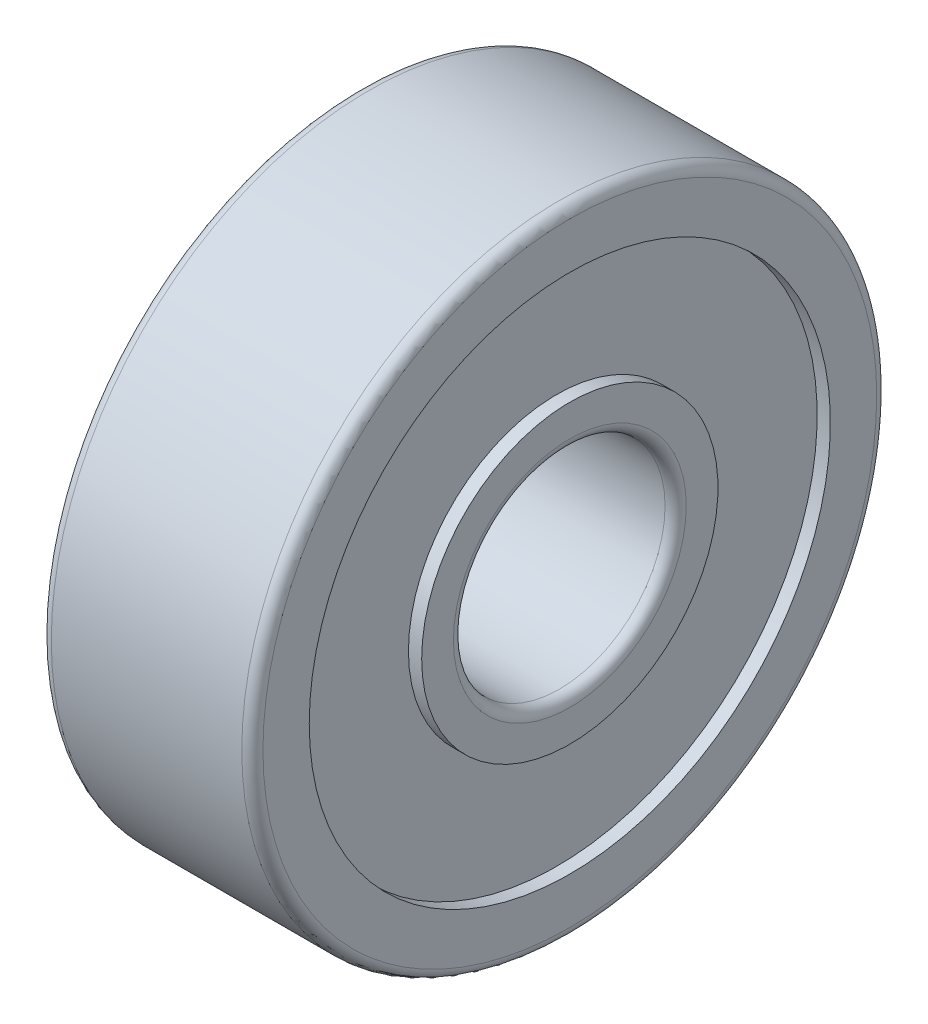
ISO-10303-21;
HEADER;
FILE_DESCRIPTION(('STEP AP214'),'2;1');
FILE_NAME('part.step','',(''),(''),'','','');
FILE_SCHEMA(('AUTOMOTIVE_DESIGN { 1 0 10303 214 1 1 1 1 }'));
ENDSEC;
DATA;
#1=APPLICATION_CONTEXT('core data for automotive mechanical design processes');
#2=APPLICATION_PROTOCOL_DEFINITION('international standard','automotive_design',2000,#1);
#3=PRODUCT_CONTEXT('',#1,'mechanical');
#4=PRODUCT('Part','Part','',(#3));
#5=PRODUCT_RELATED_PRODUCT_CATEGORY('part','',(#4));
#6=PRODUCT_DEFINITION_FORMATION('','',#4);
#7=PRODUCT_DEFINITION_CONTEXT('part definition',#1,'design');
#8=PRODUCT_DEFINITION('design','',#6,#7);
#9=PRODUCT_DEFINITION_SHAPE('','',#8);
#10=(LENGTH_UNIT() NAMED_UNIT(*) SI_UNIT(.MILLI.,.METRE.));
#11=(NAMED_UNIT(*) PLANE_ANGLE_UNIT() SI_UNIT($,.RADIAN.));
#12=(NAMED_UNIT(*) SI_UNIT($,.STERADIAN.) SOLID_ANGLE_UNIT());
#13=UNCERTAINTY_MEASURE_WITH_UNIT(LENGTH_MEASURE(1.E-05),#10,'distance_accuracy_value','');
#14=(GEOMETRIC_REPRESENTATION_CONTEXT(3) GLOBAL_UNCERTAINTY_ASSIGNED_CONTEXT((#13)) GLOBAL_UNIT_ASSIGNED_CONTEXT((#10,
#11,#12)) REPRESENTATION_CONTEXT('',''));
#15=CARTESIAN_POINT('',(0.,0.,0.));
#16=DIRECTION('',(0.,0.,1.));
#17=DIRECTION('',(1.,0.,0.));
#18=AXIS2_PLACEMENT_3D('',#15,#16,#17);
#19=CARTESIAN_POINT('',(0.2,0.,0.));
#20=DIRECTION('',(-1.,0.,0.));
#21=DIRECTION('',(0.,0.,1.));
#22=AXIS2_PLACEMENT_3D('',#19,#20,#21);
#23=TOROIDAL_SURFACE('',#22,2.2,0.2);
#24=CARTESIAN_POINT('',(0.2,0.,0.));
#25=DIRECTION('',(-1.,0.,0.));
#26=DIRECTION('',(0.,0.,1.));
#27=AXIS2_PLACEMENT_3D('',#24,#25,#26);
#28=CIRCLE('',#27,2.);
#29=CARTESIAN_POINT('',(0.2,0.,2.));
#30=VERTEX_POINT('',#29);
#31=EDGE_CURVE('E84',#30,#30,#28,.T.);
#32=ORIENTED_EDGE('',*,*,#31,.F.);
#33=EDGE_LOOP('',(#32));
#34=FACE_BOUND('',#33,.T.);
#35=CARTESIAN_POINT('',(0.,0.,0.));
#36=DIRECTION('',(-1.,0.,0.));
#37=DIRECTION('',(0.,0.,1.));
#38=AXIS2_PLACEMENT_3D('',#35,#36,#37);
#39=CIRCLE('',#38,2.2);
#40=CARTESIAN_POINT('',(0.,0.,2.2));
#41=VERTEX_POINT('',#40);
#42=EDGE_CURVE('E10',#41,#41,#39,.T.);
#43=ORIENTED_EDGE('',*,*,#42,.T.);
#44=EDGE_LOOP('',(#43));
#45=FACE_BOUND('',#44,.T.);
#46=ADVANCED_FACE('F32',(#34,#45),#23,.T.);
#47=CARTESIAN_POINT('',(0.,2.8,0.));
#48=DIRECTION('',(1.,0.,0.));
#49=DIRECTION('',(0.,0.,-1.));
#50=AXIS2_PLACEMENT_3D('',#47,#48,#49);
#51=PLANE('',#50);
#52=ORIENTED_EDGE('',*,*,#42,.F.);
#53=EDGE_LOOP('',(#52));
#54=FACE_BOUND('',#53,.T.);
#55=CARTESIAN_POINT('',(0.,0.,0.));
#56=DIRECTION('',(-1.,0.,0.));
#57=DIRECTION('',(0.,0.,1.));
#58=AXIS2_PLACEMENT_3D('',#55,#56,#57);
#59=CIRCLE('',#58,2.8);
#60=CARTESIAN_POINT('',(0.,0.,2.8));
#61=VERTEX_POINT('',#60);
#62=EDGE_CURVE('E38',#61,#61,#59,.T.);
#63=ORIENTED_EDGE('',*,*,#62,.T.);
#64=EDGE_LOOP('',(#63));
#65=FACE_BOUND('',#64,.T.);
#66=ADVANCED_FACE('F91',(#54,#65),#51,.F.);
#67=CARTESIAN_POINT('',(-0.2,0.,0.));
#68=DIRECTION('',(-1.,0.,0.));
#69=DIRECTION('',(0.,0.,1.));
#70=AXIS2_PLACEMENT_3D('',#67,#68,#69);
#71=CYLINDRICAL_SURFACE('',#70,2.8);
#72=ORIENTED_EDGE('',*,*,#62,.F.);
#73=EDGE_LOOP('',(#72));
#74=FACE_BOUND('',#73,.T.);
#75=CARTESIAN_POINT('',(0.25,0.,0.));
#76=DIRECTION('',(-1.,0.,0.));
#77=DIRECTION('',(0.,0.,1.));
#78=AXIS2_PLACEMENT_3D('',#75,#76,#77);
#79=CIRCLE('',#78,2.8);
#80=CARTESIAN_POINT('',(0.25,0.,2.8));
#81=VERTEX_POINT('',#80);
#82=EDGE_CURVE('E42',#81,#81,#79,.T.);
#83=ORIENTED_EDGE('',*,*,#82,.T.);
#84=EDGE_LOOP('',(#83));
#85=FACE_BOUND('',#84,.T.);
#86=ADVANCED_FACE('F95',(#74,#85),#71,.T.);
#87=CARTESIAN_POINT('',(0.25,4.925,0.));
#88=DIRECTION('',(1.,0.,0.));
#89=DIRECTION('',(0.,0.,-1.));
#90=AXIS2_PLACEMENT_3D('',#87,#88,#89);
#91=PLANE('',#90);
#92=ORIENTED_EDGE('',*,*,#82,.F.);
#93=EDGE_LOOP('',(#92));
#94=FACE_BOUND('',#93,.T.);
#95=CARTESIAN_POINT('',(0.25,0.,0.));
#96=DIRECTION('',(-1.,0.,0.));
#97=DIRECTION('',(0.,0.,1.));
#98=AXIS2_PLACEMENT_3D('',#95,#96,#97);
#99=CIRCLE('',#98,4.925);
#100=CARTESIAN_POINT('',(0.25,0.,4.925));
#101=VERTEX_POINT('',#100);
#102=EDGE_CURVE('E46',#101,#101,#99,.T.);
#103=ORIENTED_EDGE('',*,*,#102,.T.);
#104=EDGE_LOOP('',(#103));
#105=FACE_BOUND('',#104,.T.);
#106=ADVANCED_FACE('F100',(#94,#105),#91,.F.);
#107=CARTESIAN_POINT('',(-0.2,0.,0.));
#108=DIRECTION('',(-1.,0.,0.));
#109=DIRECTION('',(0.,0.,1.));
#110=AXIS2_PLACEMENT_3D('',#107,#108,#109);
#111=CYLINDRICAL_SURFACE('',#110,4.925);
#112=ORIENTED_EDGE('',*,*,#102,.F.);
#113=EDGE_LOOP('',(#112));
#114=FACE_BOUND('',#113,.T.);
#115=CARTESIAN_POINT('',(0.,0.,0.));
#116=DIRECTION('',(-1.,0.,0.));
#117=DIRECTION('',(0.,0.,1.));
#118=AXIS2_PLACEMENT_3D('',#115,#116,#117);
#119=CIRCLE('',#118,4.925);
#120=CARTESIAN_POINT('',(0.,0.,4.925));
#121=VERTEX_POINT('',#120);
#122=EDGE_CURVE('E51',#121,#121,#119,.T.);
#123=ORIENTED_EDGE('',*,*,#122,.T.);
#124=EDGE_LOOP('',(#123));
#125=FACE_BOUND('',#124,.T.);
#126=ADVANCED_FACE('F106',(#114,#125),#111,.F.);
#127=CARTESIAN_POINT('',(0.,5.8,0.));
#128=DIRECTION('',(1.,0.,0.));
#129=DIRECTION('',(0.,0.,-1.));
#130=AXIS2_PLACEMENT_3D('',#127,#128,#129);
#131=PLANE('',#130);
#132=ORIENTED_EDGE('',*,*,#122,.F.);
#133=EDGE_LOOP('',(#132));
#134=FACE_BOUND('',#133,.T.);
#135=CARTESIAN_POINT('',(0.,0.,0.));
#136=DIRECTION('',(-1.,0.,0.));
#137=DIRECTION('',(0.,0.,1.));
#138=AXIS2_PLACEMENT_3D('',#135,#136,#137);
#139=CIRCLE('',#138,5.8);
#140=CARTESIAN_POINT('',(0.,0.,5.8));
#141=VERTEX_POINT('',#140);
#142=EDGE_CURVE('E54',#141,#141,#139,.T.);
#143=ORIENTED_EDGE('',*,*,#142,.T.);
#144=EDGE_LOOP('',(#143));
#145=FACE_BOUND('',#144,.T.);
#146=ADVANCED_FACE('F110',(#134,#145),#131,.F.);
#147=CARTESIAN_POINT('',(0.199999999999999,0.,0.));
#148=DIRECTION('',(-1.,0.,0.));
#149=DIRECTION('',(0.,0.,1.));
#150=AXIS2_PLACEMENT_3D('',#147,#148,#149);
#151=TOROIDAL_SURFACE('',#150,5.8,0.2);
#152=ORIENTED_EDGE('',*,*,#142,.F.);
#153=EDGE_LOOP('',(#152));
#154=FACE_BOUND('',#153,.T.);
#155=CARTESIAN_POINT('',(0.199999999999999,0.,0.));
#156=DIRECTION('',(-1.,0.,0.));
#157=DIRECTION('',(0.,0.,1.));
#158=AXIS2_PLACEMENT_3D('',#155,#156,#157);
#159=CIRCLE('',#158,6.);
#160=CARTESIAN_POINT('',(0.199999999999999,0.,6.));
#161=VERTEX_POINT('',#160);
#162=EDGE_CURVE('E57',#161,#161,#159,.T.);
#163=ORIENTED_EDGE('',*,*,#162,.T.);
#164=EDGE_LOOP('',(#163));
#165=FACE_BOUND('',#164,.T.);
#166=ADVANCED_FACE('F114',(#154,#165),#151,.T.);
#167=CARTESIAN_POINT('',(-0.2,0.,0.));
#168=DIRECTION('',(-1.,0.,0.));
#169=DIRECTION('',(0.,0.,1.));
#170=AXIS2_PLACEMENT_3D('',#167,#168,#169);
#171=CYLINDRICAL_SURFACE('',#170,6.);
#172=ORIENTED_EDGE('',*,*,#162,.F.);
#173=EDGE_LOOP('',(#172));
#174=FACE_BOUND('',#173,.T.);
#175=CARTESIAN_POINT('',(3.8,0.,0.));
#176=DIRECTION('',(-1.,0.,0.));
#177=DIRECTION('',(0.,0.,1.));
#178=AXIS2_PLACEMENT_3D('',#175,#176,#177);
#179=CIRCLE('',#178,6.);
#180=CARTESIAN_POINT('',(3.8,0.,6.));
#181=VERTEX_POINT('',#180);
#182=EDGE_CURVE('E60',#181,#181,#179,.T.);
#183=ORIENTED_EDGE('',*,*,#182,.T.);
#184=EDGE_LOOP('',(#183));
#185=FACE_BOUND('',#184,.T.);
#186=ADVANCED_FACE('F118',(#174,#185),#171,.T.);
#187=CARTESIAN_POINT('',(3.8,0.,0.));
#188=DIRECTION('',(-1.,0.,0.));
#189=DIRECTION('',(0.,0.,1.));
#190=AXIS2_PLACEMENT_3D('',#187,#188,#189);
#191=TOROIDAL_SURFACE('',#190,5.8,0.2);
#192=ORIENTED_EDGE('',*,*,#182,.F.);
#193=EDGE_LOOP('',(#192));
#194=FACE_BOUND('',#193,.T.);
#195=CARTESIAN_POINT('',(4.,0.,0.));
#196=DIRECTION('',(-1.,0.,0.));
#197=DIRECTION('',(0.,0.,1.));
#198=AXIS2_PLACEMENT_3D('',#195,#196,#197);
#199=CIRCLE('',#198,5.8);
#200=CARTESIAN_POINT('',(4.,0.,5.8));
#201=VERTEX_POINT('',#200);
#202=EDGE_CURVE('E63',#201,#201,#199,.T.);
#203=ORIENTED_EDGE('',*,*,#202,.T.);
#204=EDGE_LOOP('',(#203));
#205=FACE_BOUND('',#204,.T.);
#206=ADVANCED_FACE('F122',(#194,#205),#191,.T.);
#207=CARTESIAN_POINT('',(4.,5.8,0.));
#208=DIRECTION('',(-1.,0.,0.));
#209=DIRECTION('',(0.,0.,1.));
#210=AXIS2_PLACEMENT_3D('',#207,#208,#209);
#211=PLANE('',#210);
#212=ORIENTED_EDGE('',*,*,#202,.F.);
#213=EDGE_LOOP('',(#212));
#214=FACE_BOUND('',#213,.T.);
#215=CARTESIAN_POINT('',(4.,0.,0.));
#216=DIRECTION('',(-1.,0.,0.));
#217=DIRECTION('',(0.,0.,1.));
#218=AXIS2_PLACEMENT_3D('',#215,#216,#217);
#219=CIRCLE('',#218,4.925);
#220=CARTESIAN_POINT('',(4.,0.,4.925));
#221=VERTEX_POINT('',#220);
#222=EDGE_CURVE('E66',#221,#221,#219,.T.);
#223=ORIENTED_EDGE('',*,*,#222,.T.);
#224=EDGE_LOOP('',(#223));
#225=FACE_BOUND('',#224,.T.);
#226=ADVANCED_FACE('F126',(#214,#225),#211,.F.);
#227=CARTESIAN_POINT('',(-0.2,0.,0.));
#228=DIRECTION('',(-1.,0.,0.));
#229=DIRECTION('',(0.,0.,1.));
#230=AXIS2_PLACEMENT_3D('',#227,#228,#229);
#231=CYLINDRICAL_SURFACE('',#230,4.925);
#232=ORIENTED_EDGE('',*,*,#222,.F.);
#233=EDGE_LOOP('',(#232));
#234=FACE_BOUND('',#233,.T.);
#235=CARTESIAN_POINT('',(3.75,0.,0.));
#236=DIRECTION('',(-1.,0.,0.));
#237=DIRECTION('',(0.,0.,1.));
#238=AXIS2_PLACEMENT_3D('',#235,#236,#237);
#239=CIRCLE('',#238,4.925);
#240=CARTESIAN_POINT('',(3.75,0.,4.925));
#241=VERTEX_POINT('',#240);
#242=EDGE_CURVE('E69',#241,#241,#239,.T.);
#243=ORIENTED_EDGE('',*,*,#242,.T.);
#244=EDGE_LOOP('',(#243));
#245=FACE_BOUND('',#244,.T.);
#246=ADVANCED_FACE('F130',(#234,#245),#231,.F.);
#247=CARTESIAN_POINT('',(3.75,4.925,0.));
#248=DIRECTION('',(-1.,0.,0.));
#249=DIRECTION('',(0.,0.,1.));
#250=AXIS2_PLACEMENT_3D('',#247,#248,#249);
#251=PLANE('',#250);
#252=ORIENTED_EDGE('',*,*,#242,.F.);
#253=EDGE_LOOP('',(#252));
#254=FACE_BOUND('',#253,.T.);
#255=CARTESIAN_POINT('',(3.75,0.,0.));
#256=DIRECTION('',(-1.,0.,0.));
#257=DIRECTION('',(0.,0.,1.));
#258=AXIS2_PLACEMENT_3D('',#255,#256,#257);
#259=CIRCLE('',#258,2.8);
#260=CARTESIAN_POINT('',(3.75,0.,2.8));
#261=VERTEX_POINT('',#260);
#262=EDGE_CURVE('E72',#261,#261,#259,.T.);
#263=ORIENTED_EDGE('',*,*,#262,.T.);
#264=EDGE_LOOP('',(#263));
#265=FACE_BOUND('',#264,.T.);
#266=ADVANCED_FACE('F134',(#254,#265),#251,.F.);
#267=CARTESIAN_POINT('',(-0.2,0.,0.));
#268=DIRECTION('',(-1.,0.,0.));
#269=DIRECTION('',(0.,0.,1.));
#270=AXIS2_PLACEMENT_3D('',#267,#268,#269);
#271=CYLINDRICAL_SURFACE('',#270,2.8);
#272=ORIENTED_EDGE('',*,*,#262,.F.);
#273=EDGE_LOOP('',(#272));
#274=FACE_BOUND('',#273,.T.);
#275=CARTESIAN_POINT('',(4.,0.,0.));
#276=DIRECTION('',(-1.,0.,0.));
#277=DIRECTION('',(0.,0.,1.));
#278=AXIS2_PLACEMENT_3D('',#275,#276,#277);
#279=CIRCLE('',#278,2.8);
#280=CARTESIAN_POINT('',(4.,0.,2.8));
#281=VERTEX_POINT('',#280);
#282=EDGE_CURVE('E75',#281,#281,#279,.T.);
#283=ORIENTED_EDGE('',*,*,#282,.T.);
#284=EDGE_LOOP('',(#283));
#285=FACE_BOUND('',#284,.T.);
#286=ADVANCED_FACE('F138',(#274,#285),#271,.T.);
#287=CARTESIAN_POINT('',(4.,2.8,0.));
#288=DIRECTION('',(-1.,0.,0.));
#289=DIRECTION('',(0.,0.,1.));
#290=AXIS2_PLACEMENT_3D('',#287,#288,#289);
#291=PLANE('',#290);
#292=ORIENTED_EDGE('',*,*,#282,.F.);
#293=EDGE_LOOP('',(#292));
#294=FACE_BOUND('',#293,.T.);
#295=CARTESIAN_POINT('',(4.,0.,0.));
#296=DIRECTION('',(-1.,0.,0.));
#297=DIRECTION('',(0.,0.,1.));
#298=AXIS2_PLACEMENT_3D('',#295,#296,#297);
#299=CIRCLE('',#298,2.2);
#300=CARTESIAN_POINT('',(4.,0.,2.2));
#301=VERTEX_POINT('',#300);
#302=EDGE_CURVE('E78',#301,#301,#299,.T.);
#303=ORIENTED_EDGE('',*,*,#302,.T.);
#304=EDGE_LOOP('',(#303));
#305=FACE_BOUND('',#304,.T.);
#306=ADVANCED_FACE('F142',(#294,#305),#291,.F.);
#307=CARTESIAN_POINT('',(3.8,0.,0.));
#308=DIRECTION('',(-1.,0.,0.));
#309=DIRECTION('',(0.,0.,1.));
#310=AXIS2_PLACEMENT_3D('',#307,#308,#309);
#311=TOROIDAL_SURFACE('',#310,2.2,0.2);
#312=ORIENTED_EDGE('',*,*,#302,.F.);
#313=EDGE_LOOP('',(#312));
#314=FACE_BOUND('',#313,.T.);
#315=CARTESIAN_POINT('',(3.8,0.,0.));
#316=DIRECTION('',(-1.,0.,0.));
#317=DIRECTION('',(0.,0.,1.));
#318=AXIS2_PLACEMENT_3D('',#315,#316,#317);
#319=CIRCLE('',#318,2.);
#320=CARTESIAN_POINT('',(3.8,0.,2.));
#321=VERTEX_POINT('',#320);
#322=EDGE_CURVE('E81',#321,#321,#319,.T.);
#323=ORIENTED_EDGE('',*,*,#322,.T.);
#324=EDGE_LOOP('',(#323));
#325=FACE_BOUND('',#324,.T.);
#326=ADVANCED_FACE('F146',(#314,#325),#311,.T.);
#327=CARTESIAN_POINT('',(-0.2,0.,0.));
#328=DIRECTION('',(-1.,0.,0.));
#329=DIRECTION('',(0.,0.,1.));
#330=AXIS2_PLACEMENT_3D('',#327,#328,#329);
#331=CYLINDRICAL_SURFACE('',#330,2.);
#332=ORIENTED_EDGE('',*,*,#322,.F.);
#333=EDGE_LOOP('',(#332));
#334=FACE_BOUND('',#333,.T.);
#335=ORIENTED_EDGE('',*,*,#31,.T.);
#336=EDGE_LOOP('',(#335));
#337=FACE_BOUND('',#336,.T.);
#338=ADVANCED_FACE('F88',(#334,#337),#331,.F.);
#339=CLOSED_SHELL('',(#46,#66,#86,#106,#126,#146,#166,#186,#206,#226,#246,#266,#286,#306,#326,#338));
#340=MANIFOLD_SOLID_BREP('B2',#339);
#341=ADVANCED_BREP_SHAPE_REPRESENTATION('',(#18,#340),#14);
#342=SHAPE_DEFINITION_REPRESENTATION(#9,#341);
ENDSEC;
END-ISO-10303-21;
